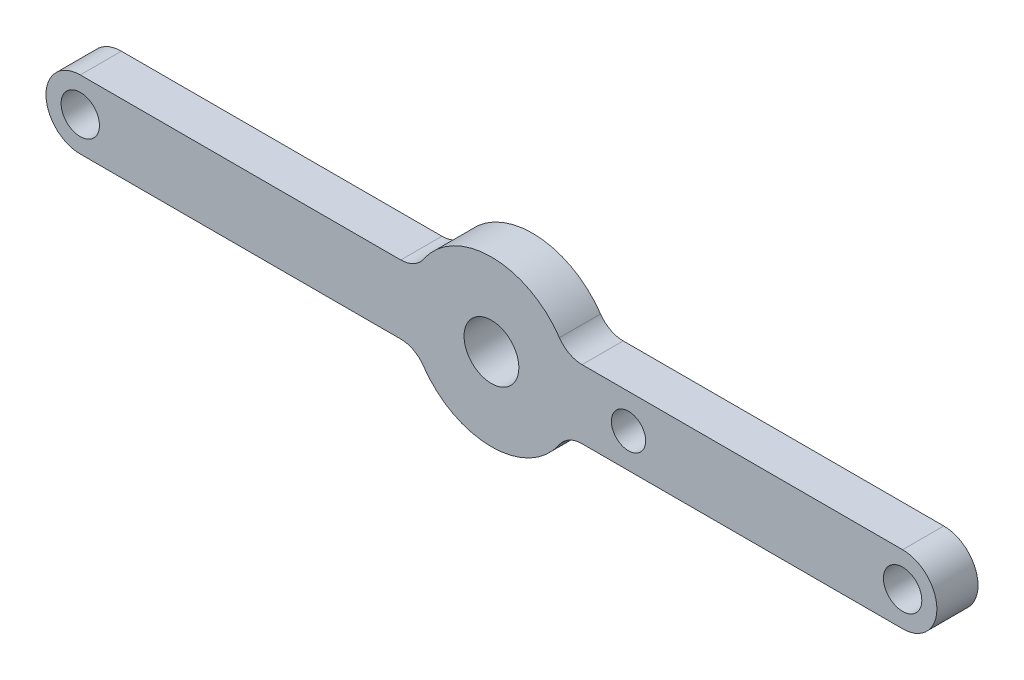
ISO-10303-21;
HEADER;
FILE_DESCRIPTION(('STEP AP214'),'2;1');
FILE_NAME('part.step','',(''),(''),'','','');
FILE_SCHEMA(('AUTOMOTIVE_DESIGN { 1 0 10303 214 1 1 1 1 }'));
ENDSEC;
DATA;
#1=APPLICATION_CONTEXT('core data for automotive mechanical design processes');
#2=APPLICATION_PROTOCOL_DEFINITION('international standard','automotive_design',2000,#1);
#3=PRODUCT_CONTEXT('',#1,'mechanical');
#4=PRODUCT('Part','Part','',(#3));
#5=PRODUCT_RELATED_PRODUCT_CATEGORY('part','',(#4));
#6=PRODUCT_DEFINITION_FORMATION('','',#4);
#7=PRODUCT_DEFINITION_CONTEXT('part definition',#1,'design');
#8=PRODUCT_DEFINITION('design','',#6,#7);
#9=PRODUCT_DEFINITION_SHAPE('','',#8);
#10=(LENGTH_UNIT() NAMED_UNIT(*) SI_UNIT(.MILLI.,.METRE.));
#11=(NAMED_UNIT(*) PLANE_ANGLE_UNIT() SI_UNIT($,.RADIAN.));
#12=(NAMED_UNIT(*) SI_UNIT($,.STERADIAN.) SOLID_ANGLE_UNIT());
#13=UNCERTAINTY_MEASURE_WITH_UNIT(LENGTH_MEASURE(1.E-05),#10,'distance_accuracy_value','');
#14=(GEOMETRIC_REPRESENTATION_CONTEXT(3) GLOBAL_UNCERTAINTY_ASSIGNED_CONTEXT((#13)) GLOBAL_UNIT_ASSIGNED_CONTEXT((#10,
#11,#12)) REPRESENTATION_CONTEXT('',''));
#15=CARTESIAN_POINT('',(0.,0.,0.));
#16=DIRECTION('',(0.,0.,1.));
#17=DIRECTION('',(1.,0.,0.));
#18=AXIS2_PLACEMENT_3D('',#15,#16,#17);
#19=CARTESIAN_POINT('',(6.61437827766148,4.5,3.));
#20=DIRECTION('',(0.,0.,1.));
#21=DIRECTION('',(1.,0.,0.));
#22=AXIS2_PLACEMENT_3D('',#19,#20,#21);
#23=PLANE('',#22);
#24=CARTESIAN_POINT('',(30.,1.04083408558608E-13,3.));
#25=DIRECTION('',(0.,0.,1.));
#26=DIRECTION('',(1.,0.,0.));
#27=AXIS2_PLACEMENT_3D('',#24,#25,#26);
#28=CIRCLE('',#27,1.4);
#29=CARTESIAN_POINT('',(31.4,1.04083408558608E-13,3.));
#30=VERTEX_POINT('',#29);
#31=EDGE_CURVE('E290',#30,#30,#28,.F.);
#32=ORIENTED_EDGE('',*,*,#31,.T.);
#33=EDGE_LOOP('',(#32));
#34=FACE_BOUND('',#33,.T.);
#35=CARTESIAN_POINT('',(-30.,1.04083408558608E-13,3.));
#36=DIRECTION('',(0.,0.,1.));
#37=DIRECTION('',(1.,0.,0.));
#38=AXIS2_PLACEMENT_3D('',#35,#36,#37);
#39=CIRCLE('',#38,1.4);
#40=CARTESIAN_POINT('',(-28.6,1.04083408558608E-13,3.));
#41=VERTEX_POINT('',#40);
#42=EDGE_CURVE('E300',#41,#41,#39,.T.);
#43=ORIENTED_EDGE('',*,*,#42,.F.);
#44=EDGE_LOOP('',(#43));
#45=FACE_BOUND('',#44,.T.);
#46=CARTESIAN_POINT('',(0.,0.,3.));
#47=DIRECTION('',(0.,0.,1.));
#48=DIRECTION('',(1.,0.,0.));
#49=AXIS2_PLACEMENT_3D('',#46,#47,#48);
#50=CIRCLE('',#49,2.);
#51=CARTESIAN_POINT('',(2.,0.,3.));
#52=VERTEX_POINT('',#51);
#53=EDGE_CURVE('E166',#52,#52,#50,.T.);
#54=ORIENTED_EDGE('',*,*,#53,.F.);
#55=EDGE_LOOP('',(#54));
#56=FACE_BOUND('',#55,.T.);
#57=CARTESIAN_POINT('',(6.61437827766148,4.5,3.));
#58=DIRECTION('',(0.,0.,-1.));
#59=DIRECTION('',(1.,0.,0.));
#60=AXIS2_PLACEMENT_3D('',#57,#58,#59);
#61=CIRCLE('',#60,2.);
#62=CARTESIAN_POINT('',(6.61437827766148,2.5,3.));
#63=VERTEX_POINT('',#62);
#64=CARTESIAN_POINT('',(4.96078370824611,3.375,3.));
#65=VERTEX_POINT('',#64);
#66=EDGE_CURVE('E186',#63,#65,#61,.T.);
#67=ORIENTED_EDGE('',*,*,#66,.T.);
#68=CARTESIAN_POINT('',(0.,0.,3.));
#69=DIRECTION('',(0.,0.,1.));
#70=DIRECTION('',(-1.,0.,0.));
#71=AXIS2_PLACEMENT_3D('',#68,#69,#70);
#72=CIRCLE('',#71,6.);
#73=CARTESIAN_POINT('',(-4.96078370824611,3.375,3.));
#74=VERTEX_POINT('',#73);
#75=EDGE_CURVE('E112',#65,#74,#72,.T.);
#76=ORIENTED_EDGE('',*,*,#75,.T.);
#77=CARTESIAN_POINT('',(-6.61437827766148,4.5,3.));
#78=DIRECTION('',(0.,0.,-1.));
#79=DIRECTION('',(-1.,0.,0.));
#80=AXIS2_PLACEMENT_3D('',#77,#78,#79);
#81=CIRCLE('',#80,2.);
#82=CARTESIAN_POINT('',(-6.61437827766148,2.5,3.));
#83=VERTEX_POINT('',#82);
#84=EDGE_CURVE('E213',#74,#83,#81,.T.);
#85=ORIENTED_EDGE('',*,*,#84,.T.);
#86=DIRECTION('',(-1.,0.,0.));
#87=VECTOR('',#86,1.);
#88=CARTESIAN_POINT('',(-6.61437827766148,2.5,3.));
#89=LINE('',#88,#87);
#90=CARTESIAN_POINT('',(-30.,2.5,3.));
#91=VERTEX_POINT('',#90);
#92=EDGE_CURVE('E231',#83,#91,#89,.T.);
#93=ORIENTED_EDGE('',*,*,#92,.T.);
#94=CARTESIAN_POINT('',(-30.,0.,3.));
#95=DIRECTION('',(0.,0.,1.));
#96=DIRECTION('',(1.,0.,0.));
#97=AXIS2_PLACEMENT_3D('',#94,#95,#96);
#98=CIRCLE('',#97,2.5);
#99=CARTESIAN_POINT('',(-30.,-2.5,3.));
#100=VERTEX_POINT('',#99);
#101=EDGE_CURVE('E228',#91,#100,#98,.T.);
#102=ORIENTED_EDGE('',*,*,#101,.T.);
#103=DIRECTION('',(1.,0.,0.));
#104=VECTOR('',#103,1.);
#105=CARTESIAN_POINT('',(-6.61437827766148,-2.5,3.));
#106=LINE('',#105,#104);
#107=CARTESIAN_POINT('',(-6.61437827766148,-2.5,3.));
#108=VERTEX_POINT('',#107);
#109=EDGE_CURVE('E230',#100,#108,#106,.T.);
#110=ORIENTED_EDGE('',*,*,#109,.T.);
#111=CARTESIAN_POINT('',(-6.61437827766148,-4.5,3.));
#112=DIRECTION('',(0.,0.,-1.));
#113=DIRECTION('',(1.,0.,0.));
#114=AXIS2_PLACEMENT_3D('',#111,#112,#113);
#115=CIRCLE('',#114,2.);
#116=CARTESIAN_POINT('',(-4.96078370824611,-3.375,3.));
#117=VERTEX_POINT('',#116);
#118=EDGE_CURVE('E233',#108,#117,#115,.T.);
#119=ORIENTED_EDGE('',*,*,#118,.T.);
#120=CARTESIAN_POINT('',(0.,0.,3.));
#121=DIRECTION('',(0.,0.,1.));
#122=DIRECTION('',(1.,0.,0.));
#123=AXIS2_PLACEMENT_3D('',#120,#121,#122);
#124=CIRCLE('',#123,6.);
#125=CARTESIAN_POINT('',(4.96078370824611,-3.375,3.));
#126=VERTEX_POINT('',#125);
#127=EDGE_CURVE('E239',#117,#126,#124,.T.);
#128=ORIENTED_EDGE('',*,*,#127,.T.);
#129=CARTESIAN_POINT('',(6.61437827766148,-4.5,3.));
#130=DIRECTION('',(0.,0.,-1.));
#131=DIRECTION('',(-1.,0.,0.));
#132=AXIS2_PLACEMENT_3D('',#129,#130,#131);
#133=CIRCLE('',#132,2.);
#134=CARTESIAN_POINT('',(6.61437827766148,-2.5,3.));
#135=VERTEX_POINT('',#134);
#136=EDGE_CURVE('E143',#126,#135,#133,.T.);
#137=ORIENTED_EDGE('',*,*,#136,.T.);
#138=DIRECTION('',(1.,0.,0.));
#139=VECTOR('',#138,1.);
#140=CARTESIAN_POINT('',(6.61437827766148,-2.5,3.));
#141=LINE('',#140,#139);
#142=CARTESIAN_POINT('',(30.,-2.5,3.));
#143=VERTEX_POINT('',#142);
#144=EDGE_CURVE('E137',#135,#143,#141,.T.);
#145=ORIENTED_EDGE('',*,*,#144,.T.);
#146=CARTESIAN_POINT('',(30.,0.,3.));
#147=DIRECTION('',(0.,0.,1.));
#148=DIRECTION('',(1.,0.,0.));
#149=AXIS2_PLACEMENT_3D('',#146,#147,#148);
#150=CIRCLE('',#149,2.5);
#151=CARTESIAN_POINT('',(30.,2.5,3.));
#152=VERTEX_POINT('',#151);
#153=EDGE_CURVE('E141',#143,#152,#150,.T.);
#154=ORIENTED_EDGE('',*,*,#153,.T.);
#155=DIRECTION('',(-1.,0.,0.));
#156=VECTOR('',#155,1.);
#157=CARTESIAN_POINT('',(6.61437827766148,2.5,3.));
#158=LINE('',#157,#156);
#159=EDGE_CURVE('E58',#152,#63,#158,.T.);
#160=ORIENTED_EDGE('',*,*,#159,.T.);
#161=EDGE_LOOP('',(#67,#76,#85,#93,#102,#110,#119,#128,#137,#145,#154,#160));
#162=FACE_BOUND('',#161,.T.);
#163=CARTESIAN_POINT('',(10.,0.,3.));
#164=DIRECTION('',(0.,0.,1.));
#165=DIRECTION('',(1.,0.,0.));
#166=AXIS2_PLACEMENT_3D('',#163,#164,#165);
#167=CIRCLE('',#166,1.25);
#168=CARTESIAN_POINT('',(11.25,0.,3.));
#169=VERTEX_POINT('',#168);
#170=EDGE_CURVE('E304',#169,#169,#167,.T.);
#171=ORIENTED_EDGE('',*,*,#170,.F.);
#172=EDGE_LOOP('',(#171));
#173=FACE_BOUND('',#172,.T.);
#174=ADVANCED_FACE('F41',(#34,#45,#56,#162,#173),#23,.T.);
#175=CARTESIAN_POINT('',(6.61437827766148,4.5,0.));
#176=DIRECTION('',(0.,0.,1.));
#177=DIRECTION('',(1.,0.,0.));
#178=AXIS2_PLACEMENT_3D('',#175,#176,#177);
#179=PLANE('',#178);
#180=CARTESIAN_POINT('',(30.,1.04083408558608E-13,0.));
#181=DIRECTION('',(0.,0.,-1.));
#182=DIRECTION('',(-1.,0.,0.));
#183=AXIS2_PLACEMENT_3D('',#180,#181,#182);
#184=CIRCLE('',#183,1.4);
#185=CARTESIAN_POINT('',(28.6,1.04083408558608E-13,0.));
#186=VERTEX_POINT('',#185);
#187=EDGE_CURVE('E293',#186,#186,#184,.T.);
#188=ORIENTED_EDGE('',*,*,#187,.F.);
#189=EDGE_LOOP('',(#188));
#190=FACE_BOUND('',#189,.T.);
#191=CARTESIAN_POINT('',(-30.,1.04083408558608E-13,0.));
#192=DIRECTION('',(0.,0.,1.));
#193=DIRECTION('',(1.,0.,0.));
#194=AXIS2_PLACEMENT_3D('',#191,#192,#193);
#195=CIRCLE('',#194,1.4);
#196=CARTESIAN_POINT('',(-28.6,1.04083408558608E-13,0.));
#197=VERTEX_POINT('',#196);
#198=EDGE_CURVE('E295',#197,#197,#195,.T.);
#199=ORIENTED_EDGE('',*,*,#198,.T.);
#200=EDGE_LOOP('',(#199));
#201=FACE_BOUND('',#200,.T.);
#202=CARTESIAN_POINT('',(6.61437827766148,4.5,0.));
#203=DIRECTION('',(0.,0.,-1.));
#204=DIRECTION('',(1.,0.,0.));
#205=AXIS2_PLACEMENT_3D('',#202,#203,#204);
#206=CIRCLE('',#205,2.);
#207=CARTESIAN_POINT('',(6.61437827766148,2.5,0.));
#208=VERTEX_POINT('',#207);
#209=CARTESIAN_POINT('',(4.96078370824611,3.375,0.));
#210=VERTEX_POINT('',#209);
#211=EDGE_CURVE('E162',#208,#210,#206,.T.);
#212=ORIENTED_EDGE('',*,*,#211,.F.);
#213=DIRECTION('',(-1.,0.,0.));
#214=VECTOR('',#213,1.);
#215=CARTESIAN_POINT('',(6.61437827766148,2.5,0.));
#216=LINE('',#215,#214);
#217=CARTESIAN_POINT('',(30.,2.5,0.));
#218=VERTEX_POINT('',#217);
#219=EDGE_CURVE('E104',#218,#208,#216,.T.);
#220=ORIENTED_EDGE('',*,*,#219,.F.);
#221=CARTESIAN_POINT('',(30.,0.,0.));
#222=DIRECTION('',(0.,0.,1.));
#223=DIRECTION('',(-1.,0.,0.));
#224=AXIS2_PLACEMENT_3D('',#221,#222,#223);
#225=CIRCLE('',#224,2.5);
#226=CARTESIAN_POINT('',(30.,-2.5,0.));
#227=VERTEX_POINT('',#226);
#228=EDGE_CURVE('E98',#227,#218,#225,.T.);
#229=ORIENTED_EDGE('',*,*,#228,.F.);
#230=DIRECTION('',(1.,0.,0.));
#231=VECTOR('',#230,1.);
#232=CARTESIAN_POINT('',(6.61437827766148,-2.5,0.));
#233=LINE('',#232,#231);
#234=CARTESIAN_POINT('',(6.61437827766148,-2.5,0.));
#235=VERTEX_POINT('',#234);
#236=EDGE_CURVE('E152',#235,#227,#233,.T.);
#237=ORIENTED_EDGE('',*,*,#236,.F.);
#238=CARTESIAN_POINT('',(6.61437827766148,-4.5,0.));
#239=DIRECTION('',(0.,0.,-1.));
#240=DIRECTION('',(-1.,0.,0.));
#241=AXIS2_PLACEMENT_3D('',#238,#239,#240);
#242=CIRCLE('',#241,2.);
#243=CARTESIAN_POINT('',(4.96078370824611,-3.375,0.));
#244=VERTEX_POINT('',#243);
#245=EDGE_CURVE('E181',#244,#235,#242,.T.);
#246=ORIENTED_EDGE('',*,*,#245,.F.);
#247=CARTESIAN_POINT('',(0.,0.,0.));
#248=DIRECTION('',(0.,0.,1.));
#249=DIRECTION('',(1.,0.,0.));
#250=AXIS2_PLACEMENT_3D('',#247,#248,#249);
#251=CIRCLE('',#250,6.);
#252=CARTESIAN_POINT('',(-4.96078370824611,-3.375,0.));
#253=VERTEX_POINT('',#252);
#254=EDGE_CURVE('E179',#253,#244,#251,.T.);
#255=ORIENTED_EDGE('',*,*,#254,.F.);
#256=CARTESIAN_POINT('',(-6.61437827766148,-4.5,0.));
#257=DIRECTION('',(0.,0.,-1.));
#258=DIRECTION('',(1.,0.,0.));
#259=AXIS2_PLACEMENT_3D('',#256,#257,#258);
#260=CIRCLE('',#259,2.);
#261=CARTESIAN_POINT('',(-6.61437827766148,-2.5,0.));
#262=VERTEX_POINT('',#261);
#263=EDGE_CURVE('E177',#262,#253,#260,.T.);
#264=ORIENTED_EDGE('',*,*,#263,.F.);
#265=DIRECTION('',(1.,0.,0.));
#266=VECTOR('',#265,1.);
#267=CARTESIAN_POINT('',(-6.61437827766148,-2.5,0.));
#268=LINE('',#267,#266);
#269=CARTESIAN_POINT('',(-30.,-2.5,0.));
#270=VERTEX_POINT('',#269);
#271=EDGE_CURVE('E175',#270,#262,#268,.T.);
#272=ORIENTED_EDGE('',*,*,#271,.F.);
#273=CARTESIAN_POINT('',(-30.,0.,0.));
#274=DIRECTION('',(0.,0.,1.));
#275=DIRECTION('',(-1.,0.,0.));
#276=AXIS2_PLACEMENT_3D('',#273,#274,#275);
#277=CIRCLE('',#276,2.5);
#278=CARTESIAN_POINT('',(-30.,2.5,0.));
#279=VERTEX_POINT('',#278);
#280=EDGE_CURVE('E173',#279,#270,#277,.T.);
#281=ORIENTED_EDGE('',*,*,#280,.F.);
#282=DIRECTION('',(-1.,0.,0.));
#283=VECTOR('',#282,1.);
#284=CARTESIAN_POINT('',(-6.61437827766148,2.5,0.));
#285=LINE('',#284,#283);
#286=CARTESIAN_POINT('',(-6.61437827766148,2.5,0.));
#287=VERTEX_POINT('',#286);
#288=EDGE_CURVE('E170',#287,#279,#285,.T.);
#289=ORIENTED_EDGE('',*,*,#288,.F.);
#290=CARTESIAN_POINT('',(-6.61437827766148,4.5,0.));
#291=DIRECTION('',(0.,0.,-1.));
#292=DIRECTION('',(-1.,0.,0.));
#293=AXIS2_PLACEMENT_3D('',#290,#291,#292);
#294=CIRCLE('',#293,2.);
#295=CARTESIAN_POINT('',(-4.96078370824611,3.375,0.));
#296=VERTEX_POINT('',#295);
#297=EDGE_CURVE('E168',#296,#287,#294,.T.);
#298=ORIENTED_EDGE('',*,*,#297,.F.);
#299=CARTESIAN_POINT('',(0.,0.,0.));
#300=DIRECTION('',(0.,0.,1.));
#301=DIRECTION('',(-1.,0.,0.));
#302=AXIS2_PLACEMENT_3D('',#299,#300,#301);
#303=CIRCLE('',#302,6.);
#304=EDGE_CURVE('E165',#210,#296,#303,.T.);
#305=ORIENTED_EDGE('',*,*,#304,.F.);
#306=EDGE_LOOP('',(#212,#220,#229,#237,#246,#255,#264,#272,#281,#289,#298,#305));
#307=FACE_BOUND('',#306,.T.);
#308=CARTESIAN_POINT('',(0.,0.,0.));
#309=DIRECTION('',(0.,0.,1.));
#310=DIRECTION('',(1.,0.,0.));
#311=AXIS2_PLACEMENT_3D('',#308,#309,#310);
#312=CIRCLE('',#311,2.);
#313=CARTESIAN_POINT('',(2.,0.,0.));
#314=VERTEX_POINT('',#313);
#315=EDGE_CURVE('E307',#314,#314,#312,.T.);
#316=ORIENTED_EDGE('',*,*,#315,.T.);
#317=EDGE_LOOP('',(#316));
#318=FACE_BOUND('',#317,.T.);
#319=CARTESIAN_POINT('',(10.,0.,0.));
#320=DIRECTION('',(0.,0.,1.));
#321=DIRECTION('',(1.,0.,0.));
#322=AXIS2_PLACEMENT_3D('',#319,#320,#321);
#323=CIRCLE('',#322,1.25);
#324=CARTESIAN_POINT('',(11.25,0.,0.));
#325=VERTEX_POINT('',#324);
#326=EDGE_CURVE('E303',#325,#325,#323,.T.);
#327=ORIENTED_EDGE('',*,*,#326,.T.);
#328=EDGE_LOOP('',(#327));
#329=FACE_BOUND('',#328,.T.);
#330=ADVANCED_FACE('F217',(#190,#201,#307,#318,#329),#179,.F.);
#331=CARTESIAN_POINT('',(6.61437827766148,4.5,3.));
#332=DIRECTION('',(0.,0.,-1.));
#333=DIRECTION('',(-1.,0.,0.));
#334=AXIS2_PLACEMENT_3D('',#331,#332,#333);
#335=CYLINDRICAL_SURFACE('',#334,2.);
#336=ORIENTED_EDGE('',*,*,#211,.T.);
#337=DIRECTION('',(0.,0.,-1.));
#338=VECTOR('',#337,1.);
#339=CARTESIAN_POINT('',(4.96078370824611,3.375,3.));
#340=LINE('',#339,#338);
#341=EDGE_CURVE('E11',#65,#210,#340,.T.);
#342=ORIENTED_EDGE('',*,*,#341,.F.);
#343=ORIENTED_EDGE('',*,*,#66,.F.);
#344=DIRECTION('',(0.,0.,-1.));
#345=VECTOR('',#344,1.);
#346=CARTESIAN_POINT('',(6.61437827766148,2.5,3.));
#347=LINE('',#346,#345);
#348=EDGE_CURVE('E158',#63,#208,#347,.T.);
#349=ORIENTED_EDGE('',*,*,#348,.T.);
#350=EDGE_LOOP('',(#336,#342,#343,#349));
#351=FACE_BOUND('',#350,.T.);
#352=ADVANCED_FACE('F43',(#351),#335,.F.);
#353=CARTESIAN_POINT('',(0.,0.,3.));
#354=DIRECTION('',(0.,0.,-1.));
#355=DIRECTION('',(-1.,0.,0.));
#356=AXIS2_PLACEMENT_3D('',#353,#354,#355);
#357=CYLINDRICAL_SURFACE('',#356,6.);
#358=ORIENTED_EDGE('',*,*,#304,.T.);
#359=DIRECTION('',(0.,0.,-1.));
#360=VECTOR('',#359,1.);
#361=CARTESIAN_POINT('',(-4.96078370824611,3.375,3.));
#362=LINE('',#361,#360);
#363=EDGE_CURVE('E50',#74,#296,#362,.T.);
#364=ORIENTED_EDGE('',*,*,#363,.F.);
#365=ORIENTED_EDGE('',*,*,#75,.F.);
#366=ORIENTED_EDGE('',*,*,#341,.T.);
#367=EDGE_LOOP('',(#358,#364,#365,#366));
#368=FACE_BOUND('',#367,.T.);
#369=ADVANCED_FACE('F341',(#368),#357,.T.);
#370=CARTESIAN_POINT('',(-6.61437827766148,4.5,3.));
#371=DIRECTION('',(0.,0.,-1.));
#372=DIRECTION('',(-1.,0.,0.));
#373=AXIS2_PLACEMENT_3D('',#370,#371,#372);
#374=CYLINDRICAL_SURFACE('',#373,2.);
#375=ORIENTED_EDGE('',*,*,#297,.T.);
#376=DIRECTION('',(0.,0.,-1.));
#377=VECTOR('',#376,1.);
#378=CARTESIAN_POINT('',(-6.61437827766148,2.5,3.));
#379=LINE('',#378,#377);
#380=EDGE_CURVE('E205',#83,#287,#379,.T.);
#381=ORIENTED_EDGE('',*,*,#380,.F.);
#382=ORIENTED_EDGE('',*,*,#84,.F.);
#383=ORIENTED_EDGE('',*,*,#363,.T.);
#384=EDGE_LOOP('',(#375,#381,#382,#383));
#385=FACE_BOUND('',#384,.T.);
#386=ADVANCED_FACE('F211',(#385),#374,.F.);
#387=CARTESIAN_POINT('',(-6.61437827766148,2.5,3.));
#388=DIRECTION('',(0.,-1.,0.));
#389=DIRECTION('',(1.,0.,0.));
#390=AXIS2_PLACEMENT_3D('',#387,#388,#389);
#391=PLANE('',#390);
#392=ORIENTED_EDGE('',*,*,#288,.T.);
#393=DIRECTION('',(0.,0.,-1.));
#394=VECTOR('',#393,1.);
#395=CARTESIAN_POINT('',(-30.,2.5,3.));
#396=LINE('',#395,#394);
#397=EDGE_CURVE('E202',#91,#279,#396,.T.);
#398=ORIENTED_EDGE('',*,*,#397,.F.);
#399=ORIENTED_EDGE('',*,*,#92,.F.);
#400=ORIENTED_EDGE('',*,*,#380,.T.);
#401=EDGE_LOOP('',(#392,#398,#399,#400));
#402=FACE_BOUND('',#401,.T.);
#403=ADVANCED_FACE('F222',(#402),#391,.F.);
#404=CARTESIAN_POINT('',(-30.,0.,3.));
#405=DIRECTION('',(0.,0.,-1.));
#406=DIRECTION('',(-1.,0.,0.));
#407=AXIS2_PLACEMENT_3D('',#404,#405,#406);
#408=CYLINDRICAL_SURFACE('',#407,2.5);
#409=ORIENTED_EDGE('',*,*,#280,.T.);
#410=DIRECTION('',(0.,0.,-1.));
#411=VECTOR('',#410,1.);
#412=CARTESIAN_POINT('',(-30.,-2.5,3.));
#413=LINE('',#412,#411);
#414=EDGE_CURVE('E199',#100,#270,#413,.T.);
#415=ORIENTED_EDGE('',*,*,#414,.F.);
#416=ORIENTED_EDGE('',*,*,#101,.F.);
#417=ORIENTED_EDGE('',*,*,#397,.T.);
#418=EDGE_LOOP('',(#409,#415,#416,#417));
#419=FACE_BOUND('',#418,.T.);
#420=ADVANCED_FACE('F226',(#419),#408,.T.);
#421=CARTESIAN_POINT('',(-6.61437827766148,-2.5,3.));
#422=DIRECTION('',(0.,1.,0.));
#423=DIRECTION('',(-1.,0.,0.));
#424=AXIS2_PLACEMENT_3D('',#421,#422,#423);
#425=PLANE('',#424);
#426=ORIENTED_EDGE('',*,*,#271,.T.);
#427=DIRECTION('',(0.,0.,-1.));
#428=VECTOR('',#427,1.);
#429=CARTESIAN_POINT('',(-6.61437827766148,-2.5,3.));
#430=LINE('',#429,#428);
#431=EDGE_CURVE('E196',#108,#262,#430,.T.);
#432=ORIENTED_EDGE('',*,*,#431,.F.);
#433=ORIENTED_EDGE('',*,*,#109,.F.);
#434=ORIENTED_EDGE('',*,*,#414,.T.);
#435=EDGE_LOOP('',(#426,#432,#433,#434));
#436=FACE_BOUND('',#435,.T.);
#437=ADVANCED_FACE('F364',(#436),#425,.F.);
#438=CARTESIAN_POINT('',(-6.61437827766148,-4.5,3.));
#439=DIRECTION('',(0.,0.,-1.));
#440=DIRECTION('',(-1.,0.,0.));
#441=AXIS2_PLACEMENT_3D('',#438,#439,#440);
#442=CYLINDRICAL_SURFACE('',#441,2.);
#443=ORIENTED_EDGE('',*,*,#263,.T.);
#444=DIRECTION('',(0.,0.,-1.));
#445=VECTOR('',#444,1.);
#446=CARTESIAN_POINT('',(-4.96078370824611,-3.375,3.));
#447=LINE('',#446,#445);
#448=EDGE_CURVE('E193',#117,#253,#447,.T.);
#449=ORIENTED_EDGE('',*,*,#448,.F.);
#450=ORIENTED_EDGE('',*,*,#118,.F.);
#451=ORIENTED_EDGE('',*,*,#431,.T.);
#452=EDGE_LOOP('',(#443,#449,#450,#451));
#453=FACE_BOUND('',#452,.T.);
#454=ADVANCED_FACE('F374',(#453),#442,.F.);
#455=CARTESIAN_POINT('',(0.,0.,3.));
#456=DIRECTION('',(0.,0.,-1.));
#457=DIRECTION('',(-1.,0.,0.));
#458=AXIS2_PLACEMENT_3D('',#455,#456,#457);
#459=CYLINDRICAL_SURFACE('',#458,6.);
#460=ORIENTED_EDGE('',*,*,#254,.T.);
#461=DIRECTION('',(0.,0.,-1.));
#462=VECTOR('',#461,1.);
#463=CARTESIAN_POINT('',(4.96078370824611,-3.375,3.));
#464=LINE('',#463,#462);
#465=EDGE_CURVE('E190',#126,#244,#464,.T.);
#466=ORIENTED_EDGE('',*,*,#465,.F.);
#467=ORIENTED_EDGE('',*,*,#127,.F.);
#468=ORIENTED_EDGE('',*,*,#448,.T.);
#469=EDGE_LOOP('',(#460,#466,#467,#468));
#470=FACE_BOUND('',#469,.T.);
#471=ADVANCED_FACE('F245',(#470),#459,.T.);
#472=CARTESIAN_POINT('',(6.61437827766148,-4.5,3.));
#473=DIRECTION('',(0.,0.,-1.));
#474=DIRECTION('',(-1.,0.,0.));
#475=AXIS2_PLACEMENT_3D('',#472,#473,#474);
#476=CYLINDRICAL_SURFACE('',#475,2.);
#477=ORIENTED_EDGE('',*,*,#245,.T.);
#478=DIRECTION('',(0.,0.,-1.));
#479=VECTOR('',#478,1.);
#480=CARTESIAN_POINT('',(6.61437827766148,-2.5,3.));
#481=LINE('',#480,#479);
#482=EDGE_CURVE('E153',#135,#235,#481,.T.);
#483=ORIENTED_EDGE('',*,*,#482,.F.);
#484=ORIENTED_EDGE('',*,*,#136,.F.);
#485=ORIENTED_EDGE('',*,*,#465,.T.);
#486=EDGE_LOOP('',(#477,#483,#484,#485));
#487=FACE_BOUND('',#486,.T.);
#488=ADVANCED_FACE('F249',(#487),#476,.F.);
#489=CARTESIAN_POINT('',(6.61437827766148,-2.5,3.));
#490=DIRECTION('',(0.,1.,0.));
#491=DIRECTION('',(-1.,0.,0.));
#492=AXIS2_PLACEMENT_3D('',#489,#490,#491);
#493=PLANE('',#492);
#494=ORIENTED_EDGE('',*,*,#236,.T.);
#495=DIRECTION('',(0.,0.,-1.));
#496=VECTOR('',#495,1.);
#497=CARTESIAN_POINT('',(30.,-2.5,3.));
#498=LINE('',#497,#496);
#499=EDGE_CURVE('E149',#143,#227,#498,.T.);
#500=ORIENTED_EDGE('',*,*,#499,.F.);
#501=ORIENTED_EDGE('',*,*,#144,.F.);
#502=ORIENTED_EDGE('',*,*,#482,.T.);
#503=EDGE_LOOP('',(#494,#500,#501,#502));
#504=FACE_BOUND('',#503,.T.);
#505=ADVANCED_FACE('F150',(#504),#493,.F.);
#506=CARTESIAN_POINT('',(30.,0.,3.));
#507=DIRECTION('',(0.,0.,-1.));
#508=DIRECTION('',(-1.,0.,0.));
#509=AXIS2_PLACEMENT_3D('',#506,#507,#508);
#510=CYLINDRICAL_SURFACE('',#509,2.5);
#511=ORIENTED_EDGE('',*,*,#228,.T.);
#512=DIRECTION('',(0.,0.,-1.));
#513=VECTOR('',#512,1.);
#514=CARTESIAN_POINT('',(30.,2.5,3.));
#515=LINE('',#514,#513);
#516=EDGE_CURVE('E154',#152,#218,#515,.T.);
#517=ORIENTED_EDGE('',*,*,#516,.F.);
#518=ORIENTED_EDGE('',*,*,#153,.F.);
#519=ORIENTED_EDGE('',*,*,#499,.T.);
#520=EDGE_LOOP('',(#511,#517,#518,#519));
#521=FACE_BOUND('',#520,.T.);
#522=ADVANCED_FACE('F156',(#521),#510,.T.);
#523=CARTESIAN_POINT('',(6.61437827766148,2.5,3.));
#524=DIRECTION('',(0.,-1.,0.));
#525=DIRECTION('',(1.,0.,0.));
#526=AXIS2_PLACEMENT_3D('',#523,#524,#525);
#527=PLANE('',#526);
#528=ORIENTED_EDGE('',*,*,#219,.T.);
#529=ORIENTED_EDGE('',*,*,#348,.F.);
#530=ORIENTED_EDGE('',*,*,#159,.F.);
#531=ORIENTED_EDGE('',*,*,#516,.T.);
#532=EDGE_LOOP('',(#528,#529,#530,#531));
#533=FACE_BOUND('',#532,.T.);
#534=ADVANCED_FACE('F253',(#533),#527,.F.);
#535=CARTESIAN_POINT('',(0.,0.,3.));
#536=DIRECTION('',(0.,0.,-1.));
#537=DIRECTION('',(-1.,0.,0.));
#538=AXIS2_PLACEMENT_3D('',#535,#536,#537);
#539=CYLINDRICAL_SURFACE('',#538,2.);
#540=ORIENTED_EDGE('',*,*,#53,.T.);
#541=EDGE_LOOP('',(#540));
#542=FACE_BOUND('',#541,.T.);
#543=ORIENTED_EDGE('',*,*,#315,.F.);
#544=EDGE_LOOP('',(#543));
#545=FACE_BOUND('',#544,.T.);
#546=ADVANCED_FACE('F255',(#542,#545),#539,.F.);
#547=CARTESIAN_POINT('',(10.,0.,3.));
#548=DIRECTION('',(0.,0.,-1.));
#549=DIRECTION('',(-1.,0.,0.));
#550=AXIS2_PLACEMENT_3D('',#547,#548,#549);
#551=CYLINDRICAL_SURFACE('',#550,1.25);
#552=ORIENTED_EDGE('',*,*,#170,.T.);
#553=EDGE_LOOP('',(#552));
#554=FACE_BOUND('',#553,.T.);
#555=ORIENTED_EDGE('',*,*,#326,.F.);
#556=EDGE_LOOP('',(#555));
#557=FACE_BOUND('',#556,.T.);
#558=ADVANCED_FACE('F261',(#554,#557),#551,.F.);
#559=CARTESIAN_POINT('',(-30.,1.04083408558608E-13,0.));
#560=DIRECTION('',(0.,0.,1.));
#561=DIRECTION('',(1.,0.,0.));
#562=AXIS2_PLACEMENT_3D('',#559,#560,#561);
#563=CYLINDRICAL_SURFACE('',#562,1.4);
#564=ORIENTED_EDGE('',*,*,#42,.T.);
#565=EDGE_LOOP('',(#564));
#566=FACE_BOUND('',#565,.T.);
#567=ORIENTED_EDGE('',*,*,#198,.F.);
#568=EDGE_LOOP('',(#567));
#569=FACE_BOUND('',#568,.T.);
#570=ADVANCED_FACE('F279',(#566,#569),#563,.F.);
#571=CARTESIAN_POINT('',(30.,1.04083408558608E-13,0.));
#572=DIRECTION('',(0.,0.,1.));
#573=DIRECTION('',(1.,0.,0.));
#574=AXIS2_PLACEMENT_3D('',#571,#572,#573);
#575=CYLINDRICAL_SURFACE('',#574,1.4);
#576=ORIENTED_EDGE('',*,*,#31,.F.);
#577=EDGE_LOOP('',(#576));
#578=FACE_BOUND('',#577,.T.);
#579=ORIENTED_EDGE('',*,*,#187,.T.);
#580=EDGE_LOOP('',(#579));
#581=FACE_BOUND('',#580,.T.);
#582=ADVANCED_FACE('F282',(#578,#581),#575,.F.);
#583=CLOSED_SHELL('',(#174,#330,#352,#369,#386,#403,#420,#437,#454,#471,#488,#505,#522,#534,
#546,#558,#570,#582));
#584=MANIFOLD_SOLID_BREP('B2',#583);
#585=ADVANCED_BREP_SHAPE_REPRESENTATION('',(#18,#584),#14);
#586=SHAPE_DEFINITION_REPRESENTATION(#9,#585);
ENDSEC;
END-ISO-10303-21;
